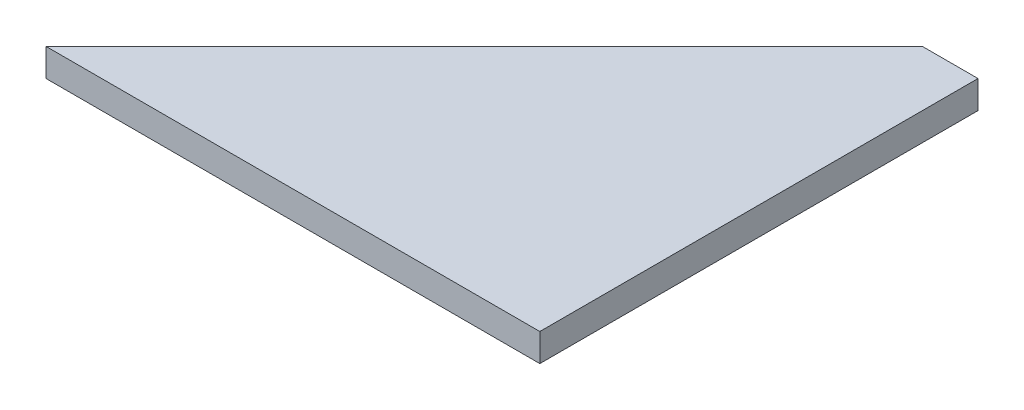
ISO-10303-21;
HEADER;
FILE_DESCRIPTION(('STEP AP214'),'2;1');
FILE_NAME('part.step','',(''),(''),'','','');
FILE_SCHEMA(('AUTOMOTIVE_DESIGN { 1 0 10303 214 1 1 1 1 }'));
ENDSEC;
DATA;
#1=APPLICATION_CONTEXT('core data for automotive mechanical design processes');
#2=APPLICATION_PROTOCOL_DEFINITION('international standard','automotive_design',2000,#1);
#3=PRODUCT_CONTEXT('',#1,'mechanical');
#4=PRODUCT('Part','Part','',(#3));
#5=PRODUCT_RELATED_PRODUCT_CATEGORY('part','',(#4));
#6=PRODUCT_DEFINITION_FORMATION('','',#4);
#7=PRODUCT_DEFINITION_CONTEXT('part definition',#1,'design');
#8=PRODUCT_DEFINITION('design','',#6,#7);
#9=PRODUCT_DEFINITION_SHAPE('','',#8);
#10=(LENGTH_UNIT() NAMED_UNIT(*) SI_UNIT(.MILLI.,.METRE.));
#11=(NAMED_UNIT(*) PLANE_ANGLE_UNIT() SI_UNIT($,.RADIAN.));
#12=(NAMED_UNIT(*) SI_UNIT($,.STERADIAN.) SOLID_ANGLE_UNIT());
#13=UNCERTAINTY_MEASURE_WITH_UNIT(LENGTH_MEASURE(1.E-05),#10,'distance_accuracy_value','');
#14=(GEOMETRIC_REPRESENTATION_CONTEXT(3) GLOBAL_UNCERTAINTY_ASSIGNED_CONTEXT((#13)) GLOBAL_UNIT_ASSIGNED_CONTEXT((#10,
#11,#12)) REPRESENTATION_CONTEXT('',''));
#15=CARTESIAN_POINT('',(0.,0.,0.));
#16=DIRECTION('',(0.,0.,1.));
#17=DIRECTION('',(1.,0.,0.));
#18=AXIS2_PLACEMENT_3D('',#15,#16,#17);
#19=CARTESIAN_POINT('',(50.,3.175,0.));
#20=DIRECTION('',(0.,0.,-1.));
#21=DIRECTION('',(-1.,0.,0.));
#22=AXIS2_PLACEMENT_3D('',#19,#20,#21);
#23=PLANE('',#22);
#24=DIRECTION('',(1.,0.,0.));
#25=VECTOR('',#24,1.);
#26=CARTESIAN_POINT('',(50.,0.,0.));
#27=LINE('',#26,#25);
#28=CARTESIAN_POINT('',(0.,0.,0.));
#29=VERTEX_POINT('',#28);
#30=CARTESIAN_POINT('',(56.35,0.,0.));
#31=VERTEX_POINT('',#30);
#32=EDGE_CURVE('E80',#29,#31,#27,.T.);
#33=ORIENTED_EDGE('',*,*,#32,.T.);
#34=DIRECTION('',(0.,-1.,0.));
#35=VECTOR('',#34,1.);
#36=CARTESIAN_POINT('',(56.35,3.175,0.));
#37=LINE('',#36,#35);
#38=CARTESIAN_POINT('',(56.35,3.175,0.));
#39=VERTEX_POINT('',#38);
#40=EDGE_CURVE('E83',#39,#31,#37,.T.);
#41=ORIENTED_EDGE('',*,*,#40,.F.);
#42=DIRECTION('',(1.,0.,0.));
#43=VECTOR('',#42,1.);
#44=CARTESIAN_POINT('',(50.,3.175,0.));
#45=LINE('',#44,#43);
#46=CARTESIAN_POINT('',(0.,3.175,0.));
#47=VERTEX_POINT('',#46);
#48=EDGE_CURVE('E66',#47,#39,#45,.T.);
#49=ORIENTED_EDGE('',*,*,#48,.F.);
#50=DIRECTION('',(0.,-1.,0.));
#51=VECTOR('',#50,1.);
#52=CARTESIAN_POINT('',(0.,3.175,0.));
#53=LINE('',#52,#51);
#54=EDGE_CURVE('E45',#47,#29,#53,.T.);
#55=ORIENTED_EDGE('',*,*,#54,.T.);
#56=EDGE_LOOP('',(#33,#41,#49,#55));
#57=FACE_BOUND('',#56,.T.);
#58=ADVANCED_FACE('F37',(#57),#23,.F.);
#59=CARTESIAN_POINT('',(0.,3.175,0.));
#60=DIRECTION('',(0.707106781186544,0.,0.707106781186551));
#61=DIRECTION('',(0.707106781186551,0.,-0.707106781186544));
#62=AXIS2_PLACEMENT_3D('',#59,#60,#61);
#63=PLANE('',#62);
#64=DIRECTION('',(-0.707106781186551,0.,0.707106781186544));
#65=VECTOR('',#64,1.);
#66=CARTESIAN_POINT('',(0.,0.,0.));
#67=LINE('',#66,#65);
#68=CARTESIAN_POINT('',(50.,0.,-49.9999999999995));
#69=VERTEX_POINT('',#68);
#70=EDGE_CURVE('E85',#69,#29,#67,.T.);
#71=ORIENTED_EDGE('',*,*,#70,.T.);
#72=ORIENTED_EDGE('',*,*,#54,.F.);
#73=DIRECTION('',(-0.707106781186551,0.,0.707106781186544));
#74=VECTOR('',#73,1.);
#75=CARTESIAN_POINT('',(0.,3.175,0.));
#76=LINE('',#75,#74);
#77=CARTESIAN_POINT('',(50.,3.175,-49.9999999999995));
#78=VERTEX_POINT('',#77);
#79=EDGE_CURVE('E53',#78,#47,#76,.T.);
#80=ORIENTED_EDGE('',*,*,#79,.F.);
#81=DIRECTION('',(0.,-1.,0.));
#82=VECTOR('',#81,1.);
#83=CARTESIAN_POINT('',(50.,3.175,-49.9999999999995));
#84=LINE('',#83,#82);
#85=EDGE_CURVE('E11',#78,#69,#84,.T.);
#86=ORIENTED_EDGE('',*,*,#85,.T.);
#87=EDGE_LOOP('',(#71,#72,#80,#86));
#88=FACE_BOUND('',#87,.T.);
#89=ADVANCED_FACE('F107',(#88),#63,.F.);
#90=CARTESIAN_POINT('',(0.,3.175,0.));
#91=DIRECTION('',(0.,1.,0.));
#92=DIRECTION('',(0.,0.,1.));
#93=AXIS2_PLACEMENT_3D('',#90,#91,#92);
#94=PLANE('',#93);
#95=ORIENTED_EDGE('',*,*,#48,.T.);
#96=DIRECTION('',(0.,0.,1.));
#97=VECTOR('',#96,1.);
#98=CARTESIAN_POINT('',(56.35,3.175,0.));
#99=LINE('',#98,#97);
#100=CARTESIAN_POINT('',(56.35,3.175,-49.9999999999995));
#101=VERTEX_POINT('',#100);
#102=EDGE_CURVE('E97',#101,#39,#99,.T.);
#103=ORIENTED_EDGE('',*,*,#102,.F.);
#104=DIRECTION('',(-1.,0.,0.));
#105=VECTOR('',#104,1.);
#106=CARTESIAN_POINT('',(56.35,3.175,-49.9999999999995));
#107=LINE('',#106,#105);
#108=EDGE_CURVE('E102',#101,#78,#107,.T.);
#109=ORIENTED_EDGE('',*,*,#108,.T.);
#110=ORIENTED_EDGE('',*,*,#79,.T.);
#111=EDGE_LOOP('',(#95,#103,#109,#110));
#112=FACE_BOUND('',#111,.T.);
#113=ADVANCED_FACE('F111',(#112),#94,.T.);
#114=CARTESIAN_POINT('',(0.,0.,0.));
#115=DIRECTION('',(0.,1.,0.));
#116=DIRECTION('',(0.,0.,1.));
#117=AXIS2_PLACEMENT_3D('',#114,#115,#116);
#118=PLANE('',#117);
#119=ORIENTED_EDGE('',*,*,#32,.F.);
#120=ORIENTED_EDGE('',*,*,#70,.F.);
#121=DIRECTION('',(-1.,0.,0.));
#122=VECTOR('',#121,1.);
#123=CARTESIAN_POINT('',(56.35,0.,-49.9999999999995));
#124=LINE('',#123,#122);
#125=CARTESIAN_POINT('',(56.35,0.,-49.9999999999995));
#126=VERTEX_POINT('',#125);
#127=EDGE_CURVE('E86',#126,#69,#124,.T.);
#128=ORIENTED_EDGE('',*,*,#127,.F.);
#129=DIRECTION('',(0.,0.,-1.));
#130=VECTOR('',#129,1.);
#131=CARTESIAN_POINT('',(56.35,0.,0.));
#132=LINE('',#131,#130);
#133=EDGE_CURVE('E89',#31,#126,#132,.T.);
#134=ORIENTED_EDGE('',*,*,#133,.F.);
#135=EDGE_LOOP('',(#119,#120,#128,#134));
#136=FACE_BOUND('',#135,.T.);
#137=ADVANCED_FACE('F90',(#136),#118,.F.);
#138=CARTESIAN_POINT('',(56.35,3.175,-49.9999999999995));
#139=DIRECTION('',(0.,0.,1.));
#140=DIRECTION('',(1.,0.,0.));
#141=AXIS2_PLACEMENT_3D('',#138,#139,#140);
#142=PLANE('',#141);
#143=ORIENTED_EDGE('',*,*,#85,.F.);
#144=ORIENTED_EDGE('',*,*,#108,.F.);
#145=DIRECTION('',(0.,1.,0.));
#146=VECTOR('',#145,1.);
#147=CARTESIAN_POINT('',(56.35,3.175,-49.9999999999995));
#148=LINE('',#147,#146);
#149=EDGE_CURVE('E94',#126,#101,#148,.T.);
#150=ORIENTED_EDGE('',*,*,#149,.F.);
#151=ORIENTED_EDGE('',*,*,#127,.T.);
#152=EDGE_LOOP('',(#143,#144,#150,#151));
#153=FACE_BOUND('',#152,.T.);
#154=ADVANCED_FACE('F109',(#153),#142,.F.);
#155=CARTESIAN_POINT('',(56.35,0.,0.));
#156=DIRECTION('',(1.,0.,0.));
#157=DIRECTION('',(0.,0.,-1.));
#158=AXIS2_PLACEMENT_3D('',#155,#156,#157);
#159=PLANE('',#158);
#160=ORIENTED_EDGE('',*,*,#40,.T.);
#161=ORIENTED_EDGE('',*,*,#133,.T.);
#162=ORIENTED_EDGE('',*,*,#149,.T.);
#163=ORIENTED_EDGE('',*,*,#102,.T.);
#164=EDGE_LOOP('',(#160,#161,#162,#163));
#165=FACE_BOUND('',#164,.T.);
#166=ADVANCED_FACE('F96',(#165),#159,.T.);
#167=CLOSED_SHELL('',(#58,#89,#113,#137,#154,#166));
#168=MANIFOLD_SOLID_BREP('B2',#167);
#169=ADVANCED_BREP_SHAPE_REPRESENTATION('',(#18,#168),#14);
#170=SHAPE_DEFINITION_REPRESENTATION(#9,#169);
ENDSEC;
END-ISO-10303-21;
